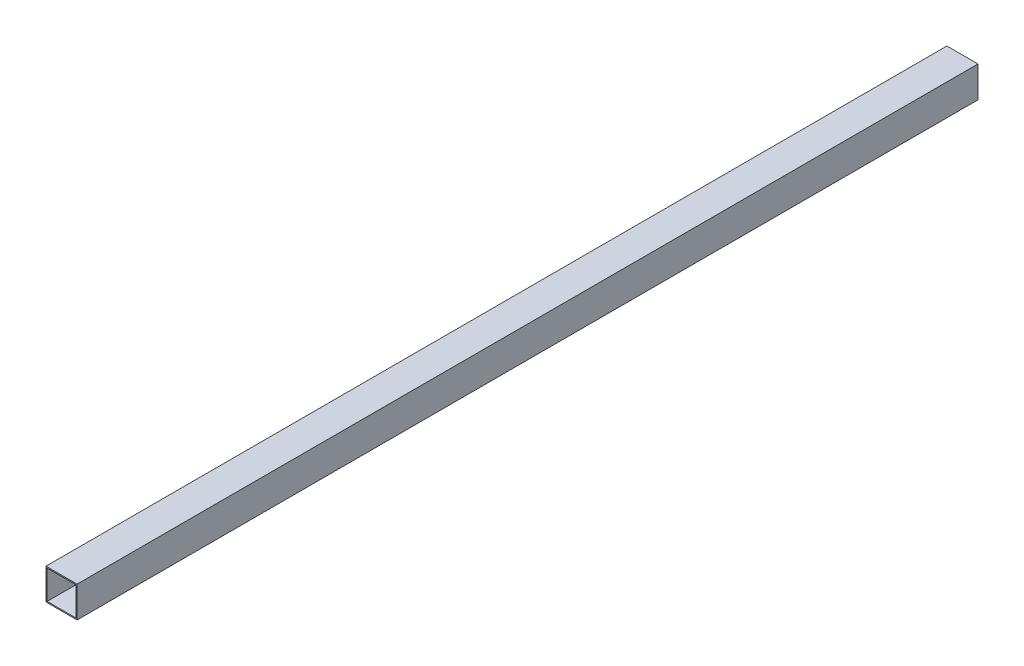
ISO-10303-21;
HEADER;
FILE_DESCRIPTION(('STEP AP214'),'2;1');
FILE_NAME('part.step','',(''),(''),'','','');
FILE_SCHEMA(('AUTOMOTIVE_DESIGN { 1 0 10303 214 1 1 1 1 }'));
ENDSEC;
DATA;
#1=APPLICATION_CONTEXT('core data for automotive mechanical design processes');
#2=APPLICATION_PROTOCOL_DEFINITION('international standard','automotive_design',2000,#1);
#3=PRODUCT_CONTEXT('',#1,'mechanical');
#4=PRODUCT('Part','Part','',(#3));
#5=PRODUCT_RELATED_PRODUCT_CATEGORY('part','',(#4));
#6=PRODUCT_DEFINITION_FORMATION('','',#4);
#7=PRODUCT_DEFINITION_CONTEXT('part definition',#1,'design');
#8=PRODUCT_DEFINITION('design','',#6,#7);
#9=PRODUCT_DEFINITION_SHAPE('','',#8);
#10=(LENGTH_UNIT() NAMED_UNIT(*) SI_UNIT(.MILLI.,.METRE.));
#11=(NAMED_UNIT(*) PLANE_ANGLE_UNIT() SI_UNIT($,.RADIAN.));
#12=(NAMED_UNIT(*) SI_UNIT($,.STERADIAN.) SOLID_ANGLE_UNIT());
#13=UNCERTAINTY_MEASURE_WITH_UNIT(LENGTH_MEASURE(1.E-05),#10,'distance_accuracy_value','');
#14=(GEOMETRIC_REPRESENTATION_CONTEXT(3) GLOBAL_UNCERTAINTY_ASSIGNED_CONTEXT((#13)) GLOBAL_UNIT_ASSIGNED_CONTEXT((#10,
#11,#12)) REPRESENTATION_CONTEXT('',''));
#15=CARTESIAN_POINT('',(0.,0.,0.));
#16=DIRECTION('',(0.,0.,1.));
#17=DIRECTION('',(1.,0.,0.));
#18=AXIS2_PLACEMENT_3D('',#15,#16,#17);
#19=CARTESIAN_POINT('',(20.,-20.,1159.));
#20=DIRECTION('',(-1.,0.,0.));
#21=DIRECTION('',(0.,0.,1.));
#22=AXIS2_PLACEMENT_3D('',#19,#20,#21);
#23=PLANE('',#22);
#24=DIRECTION('',(0.,1.,0.));
#25=VECTOR('',#24,1.);
#26=CARTESIAN_POINT('',(20.,-20.,0.));
#27=LINE('',#26,#25);
#28=CARTESIAN_POINT('',(20.,-20.,0.));
#29=VERTEX_POINT('',#28);
#30=CARTESIAN_POINT('',(20.,20.,0.));
#31=VERTEX_POINT('',#30);
#32=EDGE_CURVE('E147',#29,#31,#27,.T.);
#33=ORIENTED_EDGE('',*,*,#32,.T.);
#34=DIRECTION('',(0.,0.,-1.));
#35=VECTOR('',#34,1.);
#36=CARTESIAN_POINT('',(20.,20.,1159.));
#37=LINE('',#36,#35);
#38=CARTESIAN_POINT('',(20.,20.,1159.));
#39=VERTEX_POINT('',#38);
#40=EDGE_CURVE('E11',#39,#31,#37,.T.);
#41=ORIENTED_EDGE('',*,*,#40,.F.);
#42=DIRECTION('',(0.,1.,0.));
#43=VECTOR('',#42,1.);
#44=CARTESIAN_POINT('',(20.,-20.,1159.));
#45=LINE('',#44,#43);
#46=CARTESIAN_POINT('',(20.,-20.,1159.));
#47=VERTEX_POINT('',#46);
#48=EDGE_CURVE('E153',#47,#39,#45,.T.);
#49=ORIENTED_EDGE('',*,*,#48,.F.);
#50=DIRECTION('',(0.,0.,-1.));
#51=VECTOR('',#50,1.);
#52=CARTESIAN_POINT('',(20.,-20.,1159.));
#53=LINE('',#52,#51);
#54=EDGE_CURVE('E167',#47,#29,#53,.T.);
#55=ORIENTED_EDGE('',*,*,#54,.T.);
#56=EDGE_LOOP('',(#33,#41,#49,#55));
#57=FACE_BOUND('',#56,.T.);
#58=ADVANCED_FACE('F39',(#57),#23,.F.);
#59=CARTESIAN_POINT('',(-20.,20.,1159.));
#60=DIRECTION('',(0.,-1.,0.));
#61=DIRECTION('',(0.,0.,-1.));
#62=AXIS2_PLACEMENT_3D('',#59,#60,#61);
#63=PLANE('',#62);
#64=DIRECTION('',(-1.,0.,0.));
#65=VECTOR('',#64,1.);
#66=CARTESIAN_POINT('',(-20.,20.,0.));
#67=LINE('',#66,#65);
#68=CARTESIAN_POINT('',(-20.,20.,0.));
#69=VERTEX_POINT('',#68);
#70=EDGE_CURVE('E171',#31,#69,#67,.T.);
#71=ORIENTED_EDGE('',*,*,#70,.T.);
#72=DIRECTION('',(0.,0.,-1.));
#73=VECTOR('',#72,1.);
#74=CARTESIAN_POINT('',(-20.,20.,1159.));
#75=LINE('',#74,#73);
#76=CARTESIAN_POINT('',(-20.,20.,1159.));
#77=VERTEX_POINT('',#76);
#78=EDGE_CURVE('E47',#77,#69,#75,.T.);
#79=ORIENTED_EDGE('',*,*,#78,.F.);
#80=DIRECTION('',(-1.,0.,0.));
#81=VECTOR('',#80,1.);
#82=CARTESIAN_POINT('',(-20.,20.,1159.));
#83=LINE('',#82,#81);
#84=EDGE_CURVE('E157',#39,#77,#83,.T.);
#85=ORIENTED_EDGE('',*,*,#84,.F.);
#86=ORIENTED_EDGE('',*,*,#40,.T.);
#87=EDGE_LOOP('',(#71,#79,#85,#86));
#88=FACE_BOUND('',#87,.T.);
#89=ADVANCED_FACE('F205',(#88),#63,.F.);
#90=CARTESIAN_POINT('',(-20.,-20.,1159.));
#91=DIRECTION('',(1.,0.,0.));
#92=DIRECTION('',(0.,0.,-1.));
#93=AXIS2_PLACEMENT_3D('',#90,#91,#92);
#94=PLANE('',#93);
#95=DIRECTION('',(0.,-1.,0.));
#96=VECTOR('',#95,1.);
#97=CARTESIAN_POINT('',(-20.,-20.,0.));
#98=LINE('',#97,#96);
#99=CARTESIAN_POINT('',(-20.,-20.,0.));
#100=VERTEX_POINT('',#99);
#101=EDGE_CURVE('E174',#69,#100,#98,.T.);
#102=ORIENTED_EDGE('',*,*,#101,.T.);
#103=DIRECTION('',(0.,0.,-1.));
#104=VECTOR('',#103,1.);
#105=CARTESIAN_POINT('',(-20.,-20.,1159.));
#106=LINE('',#105,#104);
#107=CARTESIAN_POINT('',(-20.,-20.,1159.));
#108=VERTEX_POINT('',#107);
#109=EDGE_CURVE('E182',#108,#100,#106,.T.);
#110=ORIENTED_EDGE('',*,*,#109,.F.);
#111=DIRECTION('',(0.,-1.,0.));
#112=VECTOR('',#111,1.);
#113=CARTESIAN_POINT('',(-20.,-20.,1159.));
#114=LINE('',#113,#112);
#115=EDGE_CURVE('E161',#77,#108,#114,.T.);
#116=ORIENTED_EDGE('',*,*,#115,.F.);
#117=ORIENTED_EDGE('',*,*,#78,.T.);
#118=EDGE_LOOP('',(#102,#110,#116,#117));
#119=FACE_BOUND('',#118,.T.);
#120=ADVANCED_FACE('F191',(#119),#94,.F.);
#121=CARTESIAN_POINT('',(-20.,-20.,1159.));
#122=DIRECTION('',(0.,1.,0.));
#123=DIRECTION('',(0.,0.,1.));
#124=AXIS2_PLACEMENT_3D('',#121,#122,#123);
#125=PLANE('',#124);
#126=DIRECTION('',(1.,0.,0.));
#127=VECTOR('',#126,1.);
#128=CARTESIAN_POINT('',(-20.,-20.,0.));
#129=LINE('',#128,#127);
#130=EDGE_CURVE('E158',#100,#29,#129,.T.);
#131=ORIENTED_EDGE('',*,*,#130,.T.);
#132=ORIENTED_EDGE('',*,*,#54,.F.);
#133=DIRECTION('',(1.,0.,0.));
#134=VECTOR('',#133,1.);
#135=CARTESIAN_POINT('',(-20.,-20.,1159.));
#136=LINE('',#135,#134);
#137=EDGE_CURVE('E164',#108,#47,#136,.T.);
#138=ORIENTED_EDGE('',*,*,#137,.F.);
#139=ORIENTED_EDGE('',*,*,#109,.T.);
#140=EDGE_LOOP('',(#131,#132,#138,#139));
#141=FACE_BOUND('',#140,.T.);
#142=ADVANCED_FACE('F198',(#141),#125,.F.);
#143=CARTESIAN_POINT('',(0.,0.,1159.));
#144=DIRECTION('',(0.,0.,-1.));
#145=DIRECTION('',(-1.,0.,0.));
#146=AXIS2_PLACEMENT_3D('',#143,#144,#145);
#147=PLANE('',#146);
#148=DIRECTION('',(-1.,0.,0.));
#149=VECTOR('',#148,1.);
#150=CARTESIAN_POINT('',(-18.5,18.5,1159.));
#151=LINE('',#150,#149);
#152=CARTESIAN_POINT('',(18.5,18.5,1159.));
#153=VERTEX_POINT('',#152);
#154=CARTESIAN_POINT('',(-18.5,18.5,1159.));
#155=VERTEX_POINT('',#154);
#156=EDGE_CURVE('E138',#153,#155,#151,.T.);
#157=ORIENTED_EDGE('',*,*,#156,.F.);
#158=DIRECTION('',(0.,1.,0.));
#159=VECTOR('',#158,1.);
#160=CARTESIAN_POINT('',(18.5,-18.5,1159.));
#161=LINE('',#160,#159);
#162=CARTESIAN_POINT('',(18.5,-18.5,1159.));
#163=VERTEX_POINT('',#162);
#164=EDGE_CURVE('E54',#163,#153,#161,.T.);
#165=ORIENTED_EDGE('',*,*,#164,.F.);
#166=DIRECTION('',(1.,0.,0.));
#167=VECTOR('',#166,1.);
#168=CARTESIAN_POINT('',(-18.5,-18.5,1159.));
#169=LINE('',#168,#167);
#170=CARTESIAN_POINT('',(-18.5,-18.5,1159.));
#171=VERTEX_POINT('',#170);
#172=EDGE_CURVE('E125',#171,#163,#169,.T.);
#173=ORIENTED_EDGE('',*,*,#172,.F.);
#174=DIRECTION('',(0.,-1.,0.));
#175=VECTOR('',#174,1.);
#176=CARTESIAN_POINT('',(-18.5,-18.5,1159.));
#177=LINE('',#176,#175);
#178=EDGE_CURVE('E129',#155,#171,#177,.T.);
#179=ORIENTED_EDGE('',*,*,#178,.F.);
#180=EDGE_LOOP('',(#157,#165,#173,#179));
#181=FACE_BOUND('',#180,.T.);
#182=ORIENTED_EDGE('',*,*,#48,.T.);
#183=ORIENTED_EDGE('',*,*,#84,.T.);
#184=ORIENTED_EDGE('',*,*,#115,.T.);
#185=ORIENTED_EDGE('',*,*,#137,.T.);
#186=EDGE_LOOP('',(#182,#183,#184,#185));
#187=FACE_BOUND('',#186,.T.);
#188=ADVANCED_FACE('F204',(#181,#187),#147,.F.);
#189=CARTESIAN_POINT('',(0.,0.,0.));
#190=DIRECTION('',(0.,0.,-1.));
#191=DIRECTION('',(-1.,0.,0.));
#192=AXIS2_PLACEMENT_3D('',#189,#190,#191);
#193=PLANE('',#192);
#194=DIRECTION('',(0.,1.,0.));
#195=VECTOR('',#194,1.);
#196=CARTESIAN_POINT('',(18.5,-18.5,0.));
#197=LINE('',#196,#195);
#198=CARTESIAN_POINT('',(18.5,-18.5,0.));
#199=VERTEX_POINT('',#198);
#200=CARTESIAN_POINT('',(18.5,18.5,0.));
#201=VERTEX_POINT('',#200);
#202=EDGE_CURVE('E106',#199,#201,#197,.T.);
#203=ORIENTED_EDGE('',*,*,#202,.T.);
#204=DIRECTION('',(-1.,0.,0.));
#205=VECTOR('',#204,1.);
#206=CARTESIAN_POINT('',(-18.5,18.5,0.));
#207=LINE('',#206,#205);
#208=CARTESIAN_POINT('',(-18.5,18.5,0.));
#209=VERTEX_POINT('',#208);
#210=EDGE_CURVE('E116',#201,#209,#207,.T.);
#211=ORIENTED_EDGE('',*,*,#210,.T.);
#212=DIRECTION('',(0.,-1.,0.));
#213=VECTOR('',#212,1.);
#214=CARTESIAN_POINT('',(-18.5,-18.5,0.));
#215=LINE('',#214,#213);
#216=CARTESIAN_POINT('',(-18.5,-18.5,0.));
#217=VERTEX_POINT('',#216);
#218=EDGE_CURVE('E62',#209,#217,#215,.T.);
#219=ORIENTED_EDGE('',*,*,#218,.T.);
#220=DIRECTION('',(1.,0.,0.));
#221=VECTOR('',#220,1.);
#222=CARTESIAN_POINT('',(-18.5,-18.5,0.));
#223=LINE('',#222,#221);
#224=EDGE_CURVE('E113',#217,#199,#223,.T.);
#225=ORIENTED_EDGE('',*,*,#224,.T.);
#226=EDGE_LOOP('',(#203,#211,#219,#225));
#227=FACE_BOUND('',#226,.T.);
#228=ORIENTED_EDGE('',*,*,#32,.F.);
#229=ORIENTED_EDGE('',*,*,#130,.F.);
#230=ORIENTED_EDGE('',*,*,#101,.F.);
#231=ORIENTED_EDGE('',*,*,#70,.F.);
#232=EDGE_LOOP('',(#228,#229,#230,#231));
#233=FACE_BOUND('',#232,.T.);
#234=ADVANCED_FACE('F121',(#227,#233),#193,.T.);
#235=CARTESIAN_POINT('',(18.5,-18.5,0.));
#236=DIRECTION('',(1.,0.,0.));
#237=DIRECTION('',(0.,0.,-1.));
#238=AXIS2_PLACEMENT_3D('',#235,#236,#237);
#239=PLANE('',#238);
#240=ORIENTED_EDGE('',*,*,#164,.T.);
#241=DIRECTION('',(0.,0.,1.));
#242=VECTOR('',#241,1.);
#243=CARTESIAN_POINT('',(18.5,18.5,0.));
#244=LINE('',#243,#242);
#245=EDGE_CURVE('E102',#201,#153,#244,.T.);
#246=ORIENTED_EDGE('',*,*,#245,.F.);
#247=ORIENTED_EDGE('',*,*,#202,.F.);
#248=DIRECTION('',(0.,0.,1.));
#249=VECTOR('',#248,1.);
#250=CARTESIAN_POINT('',(18.5,-18.5,0.));
#251=LINE('',#250,#249);
#252=EDGE_CURVE('E144',#199,#163,#251,.T.);
#253=ORIENTED_EDGE('',*,*,#252,.T.);
#254=EDGE_LOOP('',(#240,#246,#247,#253));
#255=FACE_BOUND('',#254,.T.);
#256=ADVANCED_FACE('F104',(#255),#239,.F.);
#257=CARTESIAN_POINT('',(-18.5,-18.5,0.));
#258=DIRECTION('',(0.,-1.,0.));
#259=DIRECTION('',(0.,0.,-1.));
#260=AXIS2_PLACEMENT_3D('',#257,#258,#259);
#261=PLANE('',#260);
#262=ORIENTED_EDGE('',*,*,#172,.T.);
#263=ORIENTED_EDGE('',*,*,#252,.F.);
#264=ORIENTED_EDGE('',*,*,#224,.F.);
#265=DIRECTION('',(0.,0.,1.));
#266=VECTOR('',#265,1.);
#267=CARTESIAN_POINT('',(-18.5,-18.5,0.));
#268=LINE('',#267,#266);
#269=EDGE_CURVE('E148',#217,#171,#268,.T.);
#270=ORIENTED_EDGE('',*,*,#269,.T.);
#271=EDGE_LOOP('',(#262,#263,#264,#270));
#272=FACE_BOUND('',#271,.T.);
#273=ADVANCED_FACE('F222',(#272),#261,.F.);
#274=CARTESIAN_POINT('',(-18.5,-18.5,0.));
#275=DIRECTION('',(-1.,0.,0.));
#276=DIRECTION('',(0.,0.,1.));
#277=AXIS2_PLACEMENT_3D('',#274,#275,#276);
#278=PLANE('',#277);
#279=ORIENTED_EDGE('',*,*,#178,.T.);
#280=ORIENTED_EDGE('',*,*,#269,.F.);
#281=ORIENTED_EDGE('',*,*,#218,.F.);
#282=DIRECTION('',(0.,0.,1.));
#283=VECTOR('',#282,1.);
#284=CARTESIAN_POINT('',(-18.5,18.5,0.));
#285=LINE('',#284,#283);
#286=EDGE_CURVE('E112',#209,#155,#285,.T.);
#287=ORIENTED_EDGE('',*,*,#286,.T.);
#288=EDGE_LOOP('',(#279,#280,#281,#287));
#289=FACE_BOUND('',#288,.T.);
#290=ADVANCED_FACE('F225',(#289),#278,.F.);
#291=CARTESIAN_POINT('',(-18.5,18.5,0.));
#292=DIRECTION('',(0.,1.,0.));
#293=DIRECTION('',(0.,0.,1.));
#294=AXIS2_PLACEMENT_3D('',#291,#292,#293);
#295=PLANE('',#294);
#296=ORIENTED_EDGE('',*,*,#156,.T.);
#297=ORIENTED_EDGE('',*,*,#286,.F.);
#298=ORIENTED_EDGE('',*,*,#210,.F.);
#299=ORIENTED_EDGE('',*,*,#245,.T.);
#300=EDGE_LOOP('',(#296,#297,#298,#299));
#301=FACE_BOUND('',#300,.T.);
#302=ADVANCED_FACE('F117',(#301),#295,.F.);
#303=CLOSED_SHELL('',(#58,#89,#120,#142,#188,#234,#256,#273,#290,#302));
#304=MANIFOLD_SOLID_BREP('B2',#303);
#305=ADVANCED_BREP_SHAPE_REPRESENTATION('',(#18,#304),#14);
#306=SHAPE_DEFINITION_REPRESENTATION(#9,#305);
ENDSEC;
END-ISO-10303-21;
